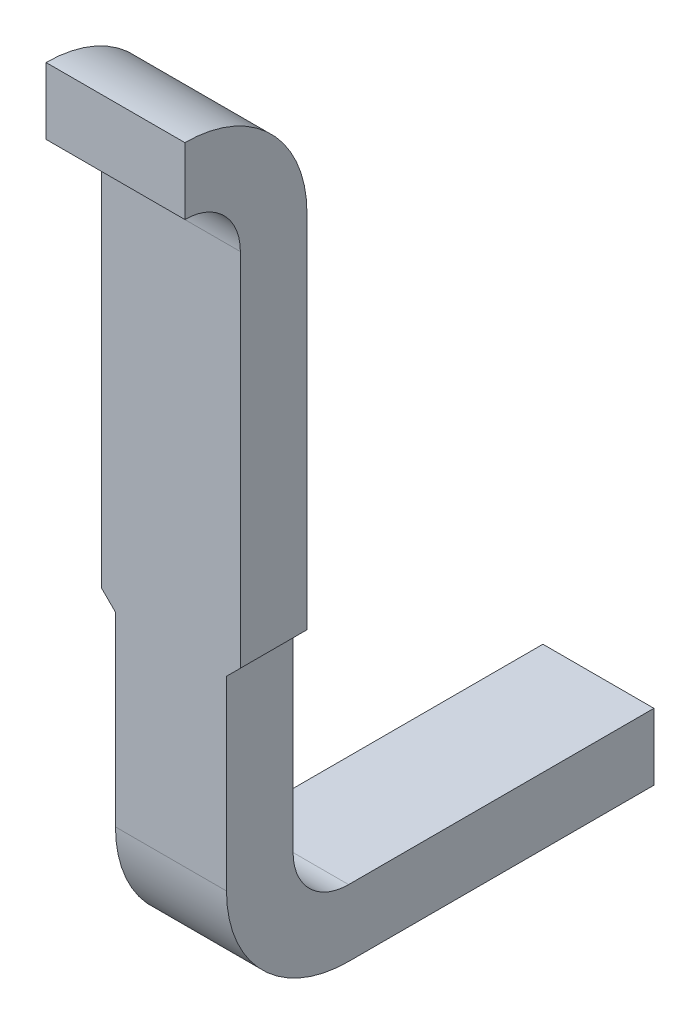
ISO-10303-21;
HEADER;
FILE_DESCRIPTION(('STEP AP214'),'2;1');
FILE_NAME('part.step','',(''),(''),'','','');
FILE_SCHEMA(('AUTOMOTIVE_DESIGN { 1 0 10303 214 1 1 1 1 }'));
ENDSEC;
DATA;
#1=APPLICATION_CONTEXT('core data for automotive mechanical design processes');
#2=APPLICATION_PROTOCOL_DEFINITION('international standard','automotive_design',2000,#1);
#3=PRODUCT_CONTEXT('',#1,'mechanical');
#4=PRODUCT('Part','Part','',(#3));
#5=PRODUCT_RELATED_PRODUCT_CATEGORY('part','',(#4));
#6=PRODUCT_DEFINITION_FORMATION('','',#4);
#7=PRODUCT_DEFINITION_CONTEXT('part definition',#1,'design');
#8=PRODUCT_DEFINITION('design','',#6,#7);
#9=PRODUCT_DEFINITION_SHAPE('','',#8);
#10=(LENGTH_UNIT() NAMED_UNIT(*) SI_UNIT(.MILLI.,.METRE.));
#11=(NAMED_UNIT(*) PLANE_ANGLE_UNIT() SI_UNIT($,.RADIAN.));
#12=(NAMED_UNIT(*) SI_UNIT($,.STERADIAN.) SOLID_ANGLE_UNIT());
#13=UNCERTAINTY_MEASURE_WITH_UNIT(LENGTH_MEASURE(1.E-05),#10,'distance_accuracy_value','');
#14=(GEOMETRIC_REPRESENTATION_CONTEXT(3) GLOBAL_UNCERTAINTY_ASSIGNED_CONTEXT((#13)) GLOBAL_UNIT_ASSIGNED_CONTEXT((#10,
#11,#12)) REPRESENTATION_CONTEXT('',''));
#15=CARTESIAN_POINT('',(0.,0.,0.));
#16=DIRECTION('',(0.,0.,1.));
#17=DIRECTION('',(1.,0.,0.));
#18=AXIS2_PLACEMENT_3D('',#15,#16,#17);
#19=CARTESIAN_POINT('',(13.46210817501,11.48941215274,-11.17169883308));
#20=DIRECTION('',(0.,0.,-1.));
#21=DIRECTION('',(-1.,0.,0.));
#22=AXIS2_PLACEMENT_3D('',#19,#20,#21);
#23=PLANE('',#22);
#24=DIRECTION('',(0.,1.,0.));
#25=VECTOR('',#24,1.);
#26=CARTESIAN_POINT('',(14.41210814532,5.079903349409,-11.17169883308));
#27=LINE('',#26,#25);
#28=CARTESIAN_POINT('',(14.41210814532,12.81951558355,-11.17169883308));
#29=VERTEX_POINT('',#28);
#30=CARTESIAN_POINT('',(14.41210814532,12.93951558355,-11.17169883308));
#31=VERTEX_POINT('',#30);
#32=EDGE_CURVE('E11',#29,#31,#27,.T.);
#33=ORIENTED_EDGE('',*,*,#32,.T.);
#34=DIRECTION('',(-1.,0.,0.));
#35=VECTOR('',#34,1.);
#36=CARTESIAN_POINT('',(13.11210817501,12.93951558355,-11.17169883308));
#37=LINE('',#36,#35);
#38=CARTESIAN_POINT('',(14.16210814532,12.93951558355,-11.17169883308));
#39=VERTEX_POINT('',#38);
#40=EDGE_CURVE('E227',#31,#39,#37,.T.);
#41=ORIENTED_EDGE('',*,*,#40,.T.);
#42=DIRECTION('',(0.,-1.,0.));
#43=VECTOR('',#42,1.);
#44=CARTESIAN_POINT('',(14.16210814532,5.079903349409,-11.17169883308));
#45=LINE('',#44,#43);
#46=CARTESIAN_POINT('',(14.16210814532,12.81951558355,-11.17169883308));
#47=VERTEX_POINT('',#46);
#48=EDGE_CURVE('E248',#39,#47,#45,.T.);
#49=ORIENTED_EDGE('',*,*,#48,.T.);
#50=DIRECTION('',(1.,0.,0.));
#51=VECTOR('',#50,1.);
#52=CARTESIAN_POINT('',(0.,12.81951558355,-11.17169883308));
#53=LINE('',#52,#51);
#54=EDGE_CURVE('E246',#47,#29,#53,.T.);
#55=ORIENTED_EDGE('',*,*,#54,.T.);
#56=EDGE_LOOP('',(#33,#41,#49,#55));
#57=FACE_BOUND('',#56,.T.);
#58=ADVANCED_FACE('F17',(#57),#23,.F.);
#59=CARTESIAN_POINT('',(14.41210814532,12.93951558355,-10.75169883308));
#60=DIRECTION('',(1.,0.,0.));
#61=DIRECTION('',(0.,0.,-1.));
#62=AXIS2_PLACEMENT_3D('',#59,#60,#61);
#63=PLANE('',#62);
#64=CARTESIAN_POINT('',(14.41210814532,12.71951558355,-11.17169883308));
#65=DIRECTION('',(-1.,0.,0.));
#66=DIRECTION('',(0.,0.,1.));
#67=AXIS2_PLACEMENT_3D('',#64,#65,#66);
#68=CIRCLE('',#67,0.22);
#69=CARTESIAN_POINT('',(14.41210814532,12.71951558355,-11.39169883308));
#70=VERTEX_POINT('',#69);
#71=EDGE_CURVE('E28',#31,#70,#68,.T.);
#72=ORIENTED_EDGE('',*,*,#71,.F.);
#73=ORIENTED_EDGE('',*,*,#32,.F.);
#74=CARTESIAN_POINT('',(14.41210814532,12.71951558355,-11.17169883308));
#75=DIRECTION('',(-1.,0.,0.));
#76=DIRECTION('',(0.,0.,-1.));
#77=AXIS2_PLACEMENT_3D('',#74,#75,#76);
#78=CIRCLE('',#77,0.1);
#79=CARTESIAN_POINT('',(14.41210814532,12.71951558355,-11.27169883308));
#80=VERTEX_POINT('',#79);
#81=EDGE_CURVE('E249',#29,#80,#78,.T.);
#82=ORIENTED_EDGE('',*,*,#81,.T.);
#83=DIRECTION('',(0.,-1.,0.));
#84=VECTOR('',#83,1.);
#85=CARTESIAN_POINT('',(14.41210814532,12.93951558355,-11.27169883308));
#86=LINE('',#85,#84);
#87=CARTESIAN_POINT('',(14.41210814532,12.06951558355,-11.27169883308));
#88=VERTEX_POINT('',#87);
#89=EDGE_CURVE('E220',#80,#88,#86,.T.);
#90=ORIENTED_EDGE('',*,*,#89,.T.);
#91=DIRECTION('',(0.,0.,-1.));
#92=VECTOR('',#91,1.);
#93=CARTESIAN_POINT('',(14.41210814532,12.06951558355,-10.75169883308));
#94=LINE('',#93,#92);
#95=CARTESIAN_POINT('',(14.41210814532,12.06951558355,-11.39169883308));
#96=VERTEX_POINT('',#95);
#97=EDGE_CURVE('E174',#88,#96,#94,.T.);
#98=ORIENTED_EDGE('',*,*,#97,.T.);
#99=DIRECTION('',(0.,1.,0.));
#100=VECTOR('',#99,1.);
#101=CARTESIAN_POINT('',(14.41210814532,12.93951558355,-11.39169883308));
#102=LINE('',#101,#100);
#103=EDGE_CURVE('E224',#96,#70,#102,.T.);
#104=ORIENTED_EDGE('',*,*,#103,.T.);
#105=EDGE_LOOP('',(#72,#73,#82,#90,#98,#104));
#106=FACE_BOUND('',#105,.T.);
#107=ADVANCED_FACE('F532',(#106),#63,.T.);
#108=CARTESIAN_POINT('',(12.81210814532,12.71951558355,-11.17169883308));
#109=DIRECTION('',(1.,0.,0.));
#110=DIRECTION('',(0.,0.,1.));
#111=AXIS2_PLACEMENT_3D('',#108,#109,#110);
#112=CYLINDRICAL_SURFACE('',#111,0.22);
#113=ORIENTED_EDGE('',*,*,#40,.F.);
#114=ORIENTED_EDGE('',*,*,#71,.T.);
#115=DIRECTION('',(-1.,0.,0.));
#116=VECTOR('',#115,1.);
#117=CARTESIAN_POINT('',(12.81210814532,12.71951558355,-11.39169883308));
#118=LINE('',#117,#116);
#119=CARTESIAN_POINT('',(14.16210814532,12.71951558355,-11.39169883308));
#120=VERTEX_POINT('',#119);
#121=EDGE_CURVE('E216',#70,#120,#118,.T.);
#122=ORIENTED_EDGE('',*,*,#121,.T.);
#123=CARTESIAN_POINT('',(14.16210814532,12.71951558355,-11.17169883308));
#124=DIRECTION('',(-1.,0.,0.));
#125=DIRECTION('',(0.,0.,1.));
#126=AXIS2_PLACEMENT_3D('',#123,#124,#125);
#127=CIRCLE('',#126,0.22);
#128=EDGE_CURVE('E230',#39,#120,#127,.T.);
#129=ORIENTED_EDGE('',*,*,#128,.F.);
#130=EDGE_LOOP('',(#113,#114,#122,#129));
#131=FACE_BOUND('',#130,.T.);
#132=ADVANCED_FACE('F333',(#131),#112,.T.);
#133=CARTESIAN_POINT('',(14.16210814532,12.93951558355,-11.91169883308));
#134=DIRECTION('',(-1.,0.,0.));
#135=DIRECTION('',(0.,1.,0.));
#136=AXIS2_PLACEMENT_3D('',#133,#134,#135);
#137=PLANE('',#136);
#138=CARTESIAN_POINT('',(14.16210814532,12.71951558355,-11.17169883308));
#139=DIRECTION('',(1.,0.,0.));
#140=DIRECTION('',(0.,0.,-1.));
#141=AXIS2_PLACEMENT_3D('',#138,#139,#140);
#142=CIRCLE('',#141,0.1);
#143=CARTESIAN_POINT('',(14.16210814532,12.71951558355,-11.27169883308));
#144=VERTEX_POINT('',#143);
#145=EDGE_CURVE('E21',#144,#47,#142,.T.);
#146=ORIENTED_EDGE('',*,*,#145,.T.);
#147=ORIENTED_EDGE('',*,*,#48,.F.);
#148=ORIENTED_EDGE('',*,*,#128,.T.);
#149=DIRECTION('',(0.,-1.,0.));
#150=VECTOR('',#149,1.);
#151=CARTESIAN_POINT('',(14.16210814532,12.93951558355,-11.39169883308));
#152=LINE('',#151,#150);
#153=CARTESIAN_POINT('',(14.16210814532,12.06951558355,-11.39169883308));
#154=VERTEX_POINT('',#153);
#155=EDGE_CURVE('E221',#120,#154,#152,.T.);
#156=ORIENTED_EDGE('',*,*,#155,.T.);
#157=DIRECTION('',(0.,0.,1.));
#158=VECTOR('',#157,1.);
#159=CARTESIAN_POINT('',(14.16210814532,12.06951558355,-11.91169883308));
#160=LINE('',#159,#158);
#161=CARTESIAN_POINT('',(14.16210814532,12.06951558355,-11.27169883308));
#162=VERTEX_POINT('',#161);
#163=EDGE_CURVE('E177',#154,#162,#160,.T.);
#164=ORIENTED_EDGE('',*,*,#163,.T.);
#165=DIRECTION('',(0.,1.,0.));
#166=VECTOR('',#165,1.);
#167=CARTESIAN_POINT('',(14.16210814532,12.93951558355,-11.27169883308));
#168=LINE('',#167,#166);
#169=EDGE_CURVE('E262',#162,#144,#168,.T.);
#170=ORIENTED_EDGE('',*,*,#169,.T.);
#171=EDGE_LOOP('',(#146,#147,#148,#156,#164,#170));
#172=FACE_BOUND('',#171,.T.);
#173=ADVANCED_FACE('F328',(#172),#137,.T.);
#174=CARTESIAN_POINT('',(19.01210814532,12.71951558355,-11.17169883308));
#175=DIRECTION('',(-1.,0.,0.));
#176=DIRECTION('',(0.,0.,-1.));
#177=AXIS2_PLACEMENT_3D('',#174,#175,#176);
#178=CYLINDRICAL_SURFACE('',#177,0.1);
#179=ORIENTED_EDGE('',*,*,#145,.F.);
#180=DIRECTION('',(-1.,0.,0.));
#181=VECTOR('',#180,1.);
#182=CARTESIAN_POINT('',(19.01210814532,12.71951558355,-11.27169883308));
#183=LINE('',#182,#181);
#184=EDGE_CURVE('E265',#80,#144,#183,.T.);
#185=ORIENTED_EDGE('',*,*,#184,.F.);
#186=ORIENTED_EDGE('',*,*,#81,.F.);
#187=ORIENTED_EDGE('',*,*,#54,.F.);
#188=EDGE_LOOP('',(#179,#185,#186,#187));
#189=FACE_BOUND('',#188,.T.);
#190=ADVANCED_FACE('F342',(#189),#178,.F.);
#191=CARTESIAN_POINT('',(14.16210814532,11.48951558355,-11.27169883308));
#192=DIRECTION('',(0.,0.,1.));
#193=DIRECTION('',(1.,0.,0.));
#194=AXIS2_PLACEMENT_3D('',#191,#192,#193);
#195=PLANE('',#194);
#196=DIRECTION('',(0.,1.,0.));
#197=VECTOR('',#196,1.);
#198=CARTESIAN_POINT('',(14.38710814532,11.48951558355,-11.27169883308));
#199=LINE('',#198,#197);
#200=CARTESIAN_POINT('',(14.38710814532,11.70951558355,-11.27169883308));
#201=VERTEX_POINT('',#200);
#202=CARTESIAN_POINT('',(14.38710814532,12.04451558355,-11.27169883308));
#203=VERTEX_POINT('',#202);
#204=EDGE_CURVE('E144',#201,#203,#199,.T.);
#205=ORIENTED_EDGE('',*,*,#204,.T.);
#206=DIRECTION('',(0.707106781186548,0.707106781186548,0.));
#207=VECTOR('',#206,1.);
#208=CARTESIAN_POINT('',(14.38710814532,12.04451558355,-11.27169883308));
#209=LINE('',#208,#207);
#210=EDGE_CURVE('E168',#203,#88,#209,.T.);
#211=ORIENTED_EDGE('',*,*,#210,.T.);
#212=ORIENTED_EDGE('',*,*,#89,.F.);
#213=ORIENTED_EDGE('',*,*,#184,.T.);
#214=ORIENTED_EDGE('',*,*,#169,.F.);
#215=DIRECTION('',(0.707106781186548,-0.707106781186548,0.));
#216=VECTOR('',#215,1.);
#217=CARTESIAN_POINT('',(14.16210814532,12.06951558355,-11.27169883308));
#218=LINE('',#217,#216);
#219=CARTESIAN_POINT('',(14.18710814532,12.04451558355,-11.27169883308));
#220=VERTEX_POINT('',#219);
#221=EDGE_CURVE('E154',#162,#220,#218,.T.);
#222=ORIENTED_EDGE('',*,*,#221,.T.);
#223=DIRECTION('',(0.,-1.,0.));
#224=VECTOR('',#223,1.);
#225=CARTESIAN_POINT('',(14.18710814532,11.48951558355,-11.27169883308));
#226=LINE('',#225,#224);
#227=CARTESIAN_POINT('',(14.18710814532,11.70951558355,-11.27169883308));
#228=VERTEX_POINT('',#227);
#229=EDGE_CURVE('E288',#220,#228,#226,.T.);
#230=ORIENTED_EDGE('',*,*,#229,.T.);
#231=DIRECTION('',(1.,0.,0.));
#232=VECTOR('',#231,1.);
#233=CARTESIAN_POINT('',(14.16210814532,11.70951558355,-11.27169883308));
#234=LINE('',#233,#232);
#235=EDGE_CURVE('E182',#228,#201,#234,.T.);
#236=ORIENTED_EDGE('',*,*,#235,.T.);
#237=EDGE_LOOP('',(#205,#211,#212,#213,#214,#222,#230,#236));
#238=FACE_BOUND('',#237,.T.);
#239=ADVANCED_FACE('F180',(#238),#195,.T.);
#240=CARTESIAN_POINT('',(12.81210814532,12.93951558355,-11.39169883308));
#241=DIRECTION('',(0.,0.,1.));
#242=DIRECTION('',(1.,0.,0.));
#243=AXIS2_PLACEMENT_3D('',#240,#241,#242);
#244=PLANE('',#243);
#245=ORIENTED_EDGE('',*,*,#103,.F.);
#246=DIRECTION('',(0.707106781186548,0.707106781186548,0.));
#247=VECTOR('',#246,1.);
#248=CARTESIAN_POINT('',(14.38710814532,12.04451558355,-11.39169883308));
#249=LINE('',#248,#247);
#250=CARTESIAN_POINT('',(14.38710814532,12.04451558355,-11.39169883308));
#251=VERTEX_POINT('',#250);
#252=EDGE_CURVE('E184',#251,#96,#249,.T.);
#253=ORIENTED_EDGE('',*,*,#252,.F.);
#254=DIRECTION('',(0.,1.,0.));
#255=VECTOR('',#254,1.);
#256=CARTESIAN_POINT('',(14.38710814532,12.93951558355,-11.39169883308));
#257=LINE('',#256,#255);
#258=CARTESIAN_POINT('',(14.38710814532,11.70951558355,-11.39169883308));
#259=VERTEX_POINT('',#258);
#260=EDGE_CURVE('E189',#259,#251,#257,.T.);
#261=ORIENTED_EDGE('',*,*,#260,.F.);
#262=DIRECTION('',(1.,0.,0.));
#263=VECTOR('',#262,1.);
#264=CARTESIAN_POINT('',(12.81210814532,11.70951558355,-11.39169883308));
#265=LINE('',#264,#263);
#266=CARTESIAN_POINT('',(14.18710814532,11.70951558355,-11.39169883308));
#267=VERTEX_POINT('',#266);
#268=EDGE_CURVE('E235',#267,#259,#265,.T.);
#269=ORIENTED_EDGE('',*,*,#268,.F.);
#270=DIRECTION('',(0.,-1.,0.));
#271=VECTOR('',#270,1.);
#272=CARTESIAN_POINT('',(14.18710814532,12.93951558355,-11.39169883308));
#273=LINE('',#272,#271);
#274=CARTESIAN_POINT('',(14.18710814532,12.04451558355,-11.39169883308));
#275=VERTEX_POINT('',#274);
#276=EDGE_CURVE('E196',#275,#267,#273,.T.);
#277=ORIENTED_EDGE('',*,*,#276,.F.);
#278=DIRECTION('',(0.707106781186548,-0.707106781186548,0.));
#279=VECTOR('',#278,1.);
#280=CARTESIAN_POINT('',(14.16210814532,12.06951558355,-11.39169883308));
#281=LINE('',#280,#279);
#282=EDGE_CURVE('E245',#154,#275,#281,.T.);
#283=ORIENTED_EDGE('',*,*,#282,.F.);
#284=ORIENTED_EDGE('',*,*,#155,.F.);
#285=ORIENTED_EDGE('',*,*,#121,.F.);
#286=EDGE_LOOP('',(#245,#253,#261,#269,#277,#283,#284,#285));
#287=FACE_BOUND('',#286,.T.);
#288=ADVANCED_FACE('F335',(#287),#244,.F.);
#289=CARTESIAN_POINT('',(14.16210814532,12.06951558355,-11.91169883308));
#290=DIRECTION('',(-0.707106781186548,-0.707106781186548,0.));
#291=DIRECTION('',(-0.707106781186548,0.707106781186548,0.));
#292=AXIS2_PLACEMENT_3D('',#289,#290,#291);
#293=PLANE('',#292);
#294=ORIENTED_EDGE('',*,*,#163,.F.);
#295=ORIENTED_EDGE('',*,*,#282,.T.);
#296=DIRECTION('',(0.,0.,1.));
#297=VECTOR('',#296,1.);
#298=CARTESIAN_POINT('',(14.18710814532,12.04451558355,-11.91169883308));
#299=LINE('',#298,#297);
#300=EDGE_CURVE('E257',#275,#220,#299,.T.);
#301=ORIENTED_EDGE('',*,*,#300,.T.);
#302=ORIENTED_EDGE('',*,*,#221,.F.);
#303=EDGE_LOOP('',(#294,#295,#301,#302));
#304=FACE_BOUND('',#303,.T.);
#305=ADVANCED_FACE('F338',(#304),#293,.T.);
#306=CARTESIAN_POINT('',(14.38210814532,12.03951558355,-8.041698833076));
#307=DIRECTION('',(-0.707106781186048,0.707106781187048,0.));
#308=DIRECTION('',(0.,0.,1.));
#309=AXIS2_PLACEMENT_3D('',#306,#307,#308);
#310=PLANE('',#309);
#311=ORIENTED_EDGE('',*,*,#252,.T.);
#312=ORIENTED_EDGE('',*,*,#97,.F.);
#313=ORIENTED_EDGE('',*,*,#210,.F.);
#314=DIRECTION('',(0.,0.,1.));
#315=VECTOR('',#314,1.);
#316=CARTESIAN_POINT('',(14.38710814532,12.04451558355,-8.041698833076));
#317=LINE('',#316,#315);
#318=EDGE_CURVE('E171',#251,#203,#317,.T.);
#319=ORIENTED_EDGE('',*,*,#318,.F.);
#320=EDGE_LOOP('',(#311,#312,#313,#319));
#321=FACE_BOUND('',#320,.T.);
#322=ADVANCED_FACE('F170',(#321),#310,.F.);
#323=CARTESIAN_POINT('',(14.38710814532,12.03951558355,-11.27169883308));
#324=DIRECTION('',(-1.,0.,0.));
#325=DIRECTION('',(0.,1.,0.));
#326=AXIS2_PLACEMENT_3D('',#323,#324,#325);
#327=PLANE('',#326);
#328=DIRECTION('',(0.,0.,-1.));
#329=VECTOR('',#328,1.);
#330=CARTESIAN_POINT('',(14.38710814532,11.60951558355,-11.27169883308));
#331=LINE('',#330,#329);
#332=CARTESIAN_POINT('',(14.38710814532,11.60951558355,-11.49169883308));
#333=VERTEX_POINT('',#332);
#334=CARTESIAN_POINT('',(14.38710814532,11.60951558355,-12.04169883308));
#335=VERTEX_POINT('',#334);
#336=EDGE_CURVE('E200',#333,#335,#331,.T.);
#337=ORIENTED_EDGE('',*,*,#336,.F.);
#338=CARTESIAN_POINT('',(14.38710814532,11.70951558355,-11.49169883308));
#339=DIRECTION('',(1.,0.,0.));
#340=DIRECTION('',(0.,0.,1.));
#341=AXIS2_PLACEMENT_3D('',#338,#339,#340);
#342=CIRCLE('',#341,0.1);
#343=EDGE_CURVE('E215',#259,#333,#342,.T.);
#344=ORIENTED_EDGE('',*,*,#343,.F.);
#345=ORIENTED_EDGE('',*,*,#260,.T.);
#346=ORIENTED_EDGE('',*,*,#318,.T.);
#347=ORIENTED_EDGE('',*,*,#204,.F.);
#348=CARTESIAN_POINT('',(14.38710814532,11.70951558355,-11.49169883308));
#349=DIRECTION('',(-1.,0.,0.));
#350=DIRECTION('',(0.,0.,-1.));
#351=AXIS2_PLACEMENT_3D('',#348,#349,#350);
#352=CIRCLE('',#351,0.22);
#353=CARTESIAN_POINT('',(14.38710814532,11.48951558355,-11.49169883308));
#354=VERTEX_POINT('',#353);
#355=EDGE_CURVE('E291',#354,#201,#352,.T.);
#356=ORIENTED_EDGE('',*,*,#355,.F.);
#357=DIRECTION('',(0.,0.,1.));
#358=VECTOR('',#357,1.);
#359=CARTESIAN_POINT('',(14.38710814532,11.48951558355,-11.27169883308));
#360=LINE('',#359,#358);
#361=CARTESIAN_POINT('',(14.38710814532,11.48951558355,-12.04169883308));
#362=VERTEX_POINT('',#361);
#363=EDGE_CURVE('E132',#362,#354,#360,.T.);
#364=ORIENTED_EDGE('',*,*,#363,.F.);
#365=DIRECTION('',(0.,-1.,0.));
#366=VECTOR('',#365,1.);
#367=CARTESIAN_POINT('',(14.38710814532,12.03951558355,-12.04169883308));
#368=LINE('',#367,#366);
#369=EDGE_CURVE('E209',#335,#362,#368,.T.);
#370=ORIENTED_EDGE('',*,*,#369,.F.);
#371=EDGE_LOOP('',(#337,#344,#345,#346,#347,#356,#364,#370));
#372=FACE_BOUND('',#371,.T.);
#373=ADVANCED_FACE('F187',(#372),#327,.F.);
#374=CARTESIAN_POINT('',(14.18710814532,12.03951558355,-11.27169883308));
#375=DIRECTION('',(1.,0.,0.));
#376=DIRECTION('',(0.,0.,-1.));
#377=AXIS2_PLACEMENT_3D('',#374,#375,#376);
#378=PLANE('',#377);
#379=DIRECTION('',(0.,0.,-1.));
#380=VECTOR('',#379,1.);
#381=CARTESIAN_POINT('',(14.18710814532,11.48951558355,-11.27169883308));
#382=LINE('',#381,#380);
#383=CARTESIAN_POINT('',(14.18710814532,11.48951558355,-11.49169883308));
#384=VERTEX_POINT('',#383);
#385=CARTESIAN_POINT('',(14.18710814532,11.48951558355,-12.04169883308));
#386=VERTEX_POINT('',#385);
#387=EDGE_CURVE('E205',#384,#386,#382,.T.);
#388=ORIENTED_EDGE('',*,*,#387,.F.);
#389=CARTESIAN_POINT('',(14.18710814532,11.70951558355,-11.49169883308));
#390=DIRECTION('',(1.,0.,0.));
#391=DIRECTION('',(0.,0.,-1.));
#392=AXIS2_PLACEMENT_3D('',#389,#390,#391);
#393=CIRCLE('',#392,0.22);
#394=EDGE_CURVE('E294',#228,#384,#393,.T.);
#395=ORIENTED_EDGE('',*,*,#394,.F.);
#396=ORIENTED_EDGE('',*,*,#229,.F.);
#397=ORIENTED_EDGE('',*,*,#300,.F.);
#398=ORIENTED_EDGE('',*,*,#276,.T.);
#399=CARTESIAN_POINT('',(14.18710814532,11.70951558355,-11.49169883308));
#400=DIRECTION('',(-1.,0.,0.));
#401=DIRECTION('',(0.,0.,1.));
#402=AXIS2_PLACEMENT_3D('',#399,#400,#401);
#403=CIRCLE('',#402,0.1);
#404=CARTESIAN_POINT('',(14.18710814532,11.60951558355,-11.49169883308));
#405=VERTEX_POINT('',#404);
#406=EDGE_CURVE('E211',#405,#267,#403,.T.);
#407=ORIENTED_EDGE('',*,*,#406,.F.);
#408=DIRECTION('',(0.,0.,1.));
#409=VECTOR('',#408,1.);
#410=CARTESIAN_POINT('',(14.18710814532,11.60951558355,-11.27169883308));
#411=LINE('',#410,#409);
#412=CARTESIAN_POINT('',(14.18710814532,11.60951558355,-12.04169883308));
#413=VERTEX_POINT('',#412);
#414=EDGE_CURVE('E122',#413,#405,#411,.T.);
#415=ORIENTED_EDGE('',*,*,#414,.F.);
#416=DIRECTION('',(0.,1.,0.));
#417=VECTOR('',#416,1.);
#418=CARTESIAN_POINT('',(14.18710814532,12.03951558355,-12.04169883308));
#419=LINE('',#418,#417);
#420=EDGE_CURVE('E210',#386,#413,#419,.T.);
#421=ORIENTED_EDGE('',*,*,#420,.F.);
#422=EDGE_LOOP('',(#388,#395,#396,#397,#398,#407,#415,#421));
#423=FACE_BOUND('',#422,.T.);
#424=ADVANCED_FACE('F19',(#423),#378,.F.);
#425=CARTESIAN_POINT('',(14.16210814532,11.70951558355,-11.49169883308));
#426=DIRECTION('',(-1.,0.,0.));
#427=DIRECTION('',(0.,0.,-1.));
#428=AXIS2_PLACEMENT_3D('',#425,#426,#427);
#429=CYLINDRICAL_SURFACE('',#428,0.22);
#430=ORIENTED_EDGE('',*,*,#235,.F.);
#431=ORIENTED_EDGE('',*,*,#394,.T.);
#432=DIRECTION('',(1.,0.,0.));
#433=VECTOR('',#432,1.);
#434=CARTESIAN_POINT('',(14.16210814532,11.48951558355,-11.49169883308));
#435=LINE('',#434,#433);
#436=EDGE_CURVE('E204',#384,#354,#435,.T.);
#437=ORIENTED_EDGE('',*,*,#436,.T.);
#438=ORIENTED_EDGE('',*,*,#355,.T.);
#439=EDGE_LOOP('',(#430,#431,#437,#438));
#440=FACE_BOUND('',#439,.T.);
#441=ADVANCED_FACE('F456',(#440),#429,.T.);
#442=CARTESIAN_POINT('',(12.81210814532,11.70951558355,-11.49169883308));
#443=DIRECTION('',(1.,0.,0.));
#444=DIRECTION('',(0.,0.,1.));
#445=AXIS2_PLACEMENT_3D('',#442,#443,#444);
#446=CYLINDRICAL_SURFACE('',#445,0.1);
#447=ORIENTED_EDGE('',*,*,#268,.T.);
#448=ORIENTED_EDGE('',*,*,#343,.T.);
#449=DIRECTION('',(1.,0.,0.));
#450=VECTOR('',#449,1.);
#451=CARTESIAN_POINT('',(12.81210814532,11.60951558355,-11.49169883308));
#452=LINE('',#451,#450);
#453=EDGE_CURVE('E251',#405,#333,#452,.T.);
#454=ORIENTED_EDGE('',*,*,#453,.F.);
#455=ORIENTED_EDGE('',*,*,#406,.T.);
#456=EDGE_LOOP('',(#447,#448,#454,#455));
#457=FACE_BOUND('',#456,.T.);
#458=ADVANCED_FACE('F445',(#457),#446,.F.);
#459=CARTESIAN_POINT('',(12.81210814532,11.60951558355,-11.91169883308));
#460=DIRECTION('',(0.,-1.,0.));
#461=DIRECTION('',(0.,0.,-1.));
#462=AXIS2_PLACEMENT_3D('',#459,#460,#461);
#463=PLANE('',#462);
#464=ORIENTED_EDGE('',*,*,#414,.T.);
#465=ORIENTED_EDGE('',*,*,#453,.T.);
#466=ORIENTED_EDGE('',*,*,#336,.T.);
#467=DIRECTION('',(-1.,0.,0.));
#468=VECTOR('',#467,1.);
#469=CARTESIAN_POINT('',(12.02567879084,11.60951558355,-12.04169883308));
#470=LINE('',#469,#468);
#471=EDGE_CURVE('E206',#335,#413,#470,.T.);
#472=ORIENTED_EDGE('',*,*,#471,.T.);
#473=EDGE_LOOP('',(#464,#465,#466,#472));
#474=FACE_BOUND('',#473,.T.);
#475=ADVANCED_FACE('F434',(#474),#463,.F.);
#476=CARTESIAN_POINT('',(18.61210814532,11.48951558355,-8.041698833076));
#477=DIRECTION('',(0.,-1.,0.));
#478=DIRECTION('',(0.,0.,-1.));
#479=AXIS2_PLACEMENT_3D('',#476,#477,#478);
#480=PLANE('',#479);
#481=ORIENTED_EDGE('',*,*,#387,.T.);
#482=DIRECTION('',(1.,0.,0.));
#483=VECTOR('',#482,1.);
#484=CARTESIAN_POINT('',(12.02567879084,11.48951558355,-12.04169883308));
#485=LINE('',#484,#483);
#486=EDGE_CURVE('E234',#386,#362,#485,.T.);
#487=ORIENTED_EDGE('',*,*,#486,.T.);
#488=ORIENTED_EDGE('',*,*,#363,.T.);
#489=ORIENTED_EDGE('',*,*,#436,.F.);
#490=EDGE_LOOP('',(#481,#487,#488,#489));
#491=FACE_BOUND('',#490,.T.);
#492=ADVANCED_FACE('F421',(#491),#480,.T.);
#493=CARTESIAN_POINT('',(12.02567879084,1.609515583551,-12.04169883308));
#494=DIRECTION('',(0.,0.,1.));
#495=DIRECTION('',(1.,0.,0.));
#496=AXIS2_PLACEMENT_3D('',#493,#494,#495);
#497=PLANE('',#496);
#498=ORIENTED_EDGE('',*,*,#486,.F.);
#499=ORIENTED_EDGE('',*,*,#420,.T.);
#500=ORIENTED_EDGE('',*,*,#471,.F.);
#501=ORIENTED_EDGE('',*,*,#369,.T.);
#502=EDGE_LOOP('',(#498,#499,#500,#501));
#503=FACE_BOUND('',#502,.T.);
#504=ADVANCED_FACE('F415',(#503),#497,.F.);
#505=CLOSED_SHELL('',(#58,#107,#132,#173,#190,#239,#288,#305,#322,#373,#424,#441,#458,#475,#492,#504));
#506=MANIFOLD_SOLID_BREP('B1',#505);
#507=ADVANCED_BREP_SHAPE_REPRESENTATION('',(#18,#506),#14);
#508=SHAPE_DEFINITION_REPRESENTATION(#9,#507);
ENDSEC;
END-ISO-10303-21;
